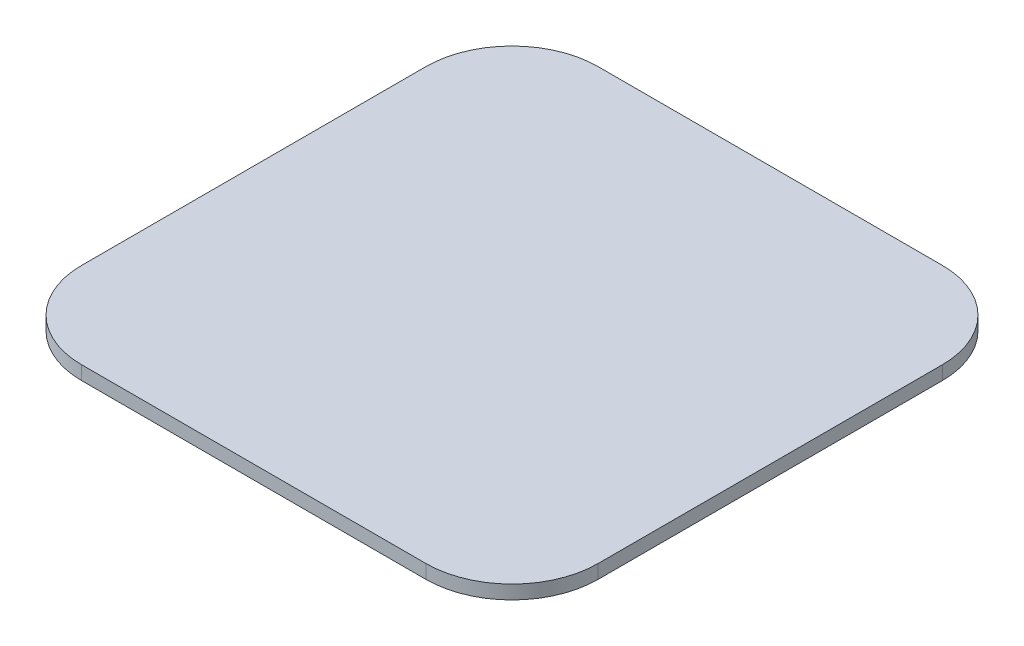
ISO-10303-21;
HEADER;
FILE_DESCRIPTION(('STEP AP214'),'2;1');
FILE_NAME('part.step','',(''),(''),'','','');
FILE_SCHEMA(('AUTOMOTIVE_DESIGN { 1 0 10303 214 1 1 1 1 }'));
ENDSEC;
DATA;
#1=APPLICATION_CONTEXT('core data for automotive mechanical design processes');
#2=APPLICATION_PROTOCOL_DEFINITION('international standard','automotive_design',2000,#1);
#3=PRODUCT_CONTEXT('',#1,'mechanical');
#4=PRODUCT('Part','Part','',(#3));
#5=PRODUCT_RELATED_PRODUCT_CATEGORY('part','',(#4));
#6=PRODUCT_DEFINITION_FORMATION('','',#4);
#7=PRODUCT_DEFINITION_CONTEXT('part definition',#1,'design');
#8=PRODUCT_DEFINITION('design','',#6,#7);
#9=PRODUCT_DEFINITION_SHAPE('','',#8);
#10=(LENGTH_UNIT() NAMED_UNIT(*) SI_UNIT(.MILLI.,.METRE.));
#11=(NAMED_UNIT(*) PLANE_ANGLE_UNIT() SI_UNIT($,.RADIAN.));
#12=(NAMED_UNIT(*) SI_UNIT($,.STERADIAN.) SOLID_ANGLE_UNIT());
#13=UNCERTAINTY_MEASURE_WITH_UNIT(LENGTH_MEASURE(1.E-05),#10,'distance_accuracy_value','');
#14=(GEOMETRIC_REPRESENTATION_CONTEXT(3) GLOBAL_UNCERTAINTY_ASSIGNED_CONTEXT((#13)) GLOBAL_UNIT_ASSIGNED_CONTEXT((#10,
#11,#12)) REPRESENTATION_CONTEXT('',''));
#15=CARTESIAN_POINT('',(0.,0.,0.));
#16=DIRECTION('',(0.,0.,1.));
#17=DIRECTION('',(1.,0.,0.));
#18=AXIS2_PLACEMENT_3D('',#15,#16,#17);
#19=CARTESIAN_POINT('',(0.,0.2,0.));
#20=DIRECTION('',(0.,-1.,0.));
#21=DIRECTION('',(0.,0.,-1.));
#22=AXIS2_PLACEMENT_3D('',#19,#20,#21);
#23=CYLINDRICAL_SURFACE('',#22,5.);
#24=CARTESIAN_POINT('',(0.,0.2,0.));
#25=DIRECTION('',(0.,1.,0.));
#26=DIRECTION('',(0.,0.,1.));
#27=AXIS2_PLACEMENT_3D('',#24,#25,#26);
#28=CIRCLE('',#27,5.);
#29=CARTESIAN_POINT('',(0.,0.2,5.));
#30=VERTEX_POINT('',#29);
#31=EDGE_CURVE('E139',#30,#30,#28,.T.);
#32=ORIENTED_EDGE('',*,*,#31,.F.);
#33=EDGE_LOOP('',(#32));
#34=FACE_BOUND('',#33,.T.);
#35=CARTESIAN_POINT('',(0.,0.,0.));
#36=DIRECTION('',(0.,1.,0.));
#37=DIRECTION('',(0.,0.,1.));
#38=AXIS2_PLACEMENT_3D('',#35,#36,#37);
#39=CIRCLE('',#38,5.);
#40=CARTESIAN_POINT('',(0.,0.,5.));
#41=VERTEX_POINT('',#40);
#42=EDGE_CURVE('E142',#41,#41,#39,.T.);
#43=ORIENTED_EDGE('',*,*,#42,.T.);
#44=EDGE_LOOP('',(#43));
#45=FACE_BOUND('',#44,.T.);
#46=ADVANCED_FACE('F35',(#34,#45),#23,.T.);
#47=CARTESIAN_POINT('',(0.,0.,0.));
#48=DIRECTION('',(0.,1.,0.));
#49=DIRECTION('',(0.,0.,1.));
#50=AXIS2_PLACEMENT_3D('',#47,#48,#49);
#51=PLANE('',#50);
#52=ORIENTED_EDGE('',*,*,#42,.F.);
#53=EDGE_LOOP('',(#52));
#54=FACE_BOUND('',#53,.T.);
#55=ADVANCED_FACE('F192',(#54),#51,.F.);
#56=CARTESIAN_POINT('',(7.5,0.6,-7.5));
#57=DIRECTION('',(-1.,0.,0.));
#58=DIRECTION('',(0.,0.,1.));
#59=AXIS2_PLACEMENT_3D('',#56,#57,#58);
#60=PLANE('',#59);
#61=DIRECTION('',(0.,0.,-1.));
#62=VECTOR('',#61,1.);
#63=CARTESIAN_POINT('',(7.5,0.6,-7.5));
#64=LINE('',#63,#62);
#65=CARTESIAN_POINT('',(7.5,0.6,5.));
#66=VERTEX_POINT('',#65);
#67=CARTESIAN_POINT('',(7.5,0.6,-5.));
#68=VERTEX_POINT('',#67);
#69=EDGE_CURVE('E121',#66,#68,#64,.T.);
#70=ORIENTED_EDGE('',*,*,#69,.F.);
#71=DIRECTION('',(0.,-1.,0.));
#72=VECTOR('',#71,1.);
#73=CARTESIAN_POINT('',(7.5,0.6,5.));
#74=LINE('',#73,#72);
#75=CARTESIAN_POINT('',(7.5,0.2,5.));
#76=VERTEX_POINT('',#75);
#77=EDGE_CURVE('E105',#66,#76,#74,.T.);
#78=ORIENTED_EDGE('',*,*,#77,.T.);
#79=DIRECTION('',(0.,0.,-1.));
#80=VECTOR('',#79,1.);
#81=CARTESIAN_POINT('',(7.5,0.2,-7.5));
#82=LINE('',#81,#80);
#83=CARTESIAN_POINT('',(7.5,0.2,-5.));
#84=VERTEX_POINT('',#83);
#85=EDGE_CURVE('E118',#76,#84,#82,.T.);
#86=ORIENTED_EDGE('',*,*,#85,.T.);
#87=DIRECTION('',(0.,-1.,0.));
#88=VECTOR('',#87,1.);
#89=CARTESIAN_POINT('',(7.5,0.6,-5.));
#90=LINE('',#89,#88);
#91=EDGE_CURVE('E123',#84,#68,#90,.F.);
#92=ORIENTED_EDGE('',*,*,#91,.T.);
#93=EDGE_LOOP('',(#70,#78,#86,#92));
#94=FACE_BOUND('',#93,.T.);
#95=ADVANCED_FACE('F117',(#94),#60,.F.);
#96=CARTESIAN_POINT('',(-7.5,0.6,-7.5));
#97=DIRECTION('',(0.,0.,1.));
#98=DIRECTION('',(1.,0.,0.));
#99=AXIS2_PLACEMENT_3D('',#96,#97,#98);
#100=PLANE('',#99);
#101=DIRECTION('',(-1.,0.,0.));
#102=VECTOR('',#101,1.);
#103=CARTESIAN_POINT('',(-7.5,0.6,-7.5));
#104=LINE('',#103,#102);
#105=CARTESIAN_POINT('',(5.,0.6,-7.5));
#106=VERTEX_POINT('',#105);
#107=CARTESIAN_POINT('',(-5.,0.6,-7.5));
#108=VERTEX_POINT('',#107);
#109=EDGE_CURVE('E169',#106,#108,#104,.T.);
#110=ORIENTED_EDGE('',*,*,#109,.F.);
#111=DIRECTION('',(0.,-1.,0.));
#112=VECTOR('',#111,1.);
#113=CARTESIAN_POINT('',(5.,0.6,-7.5));
#114=LINE('',#113,#112);
#115=CARTESIAN_POINT('',(5.,0.2,-7.5));
#116=VERTEX_POINT('',#115);
#117=EDGE_CURVE('E162',#106,#116,#114,.T.);
#118=ORIENTED_EDGE('',*,*,#117,.T.);
#119=DIRECTION('',(-1.,0.,0.));
#120=VECTOR('',#119,1.);
#121=CARTESIAN_POINT('',(-7.5,0.2,-7.5));
#122=LINE('',#121,#120);
#123=CARTESIAN_POINT('',(-5.,0.2,-7.5));
#124=VERTEX_POINT('',#123);
#125=EDGE_CURVE('E127',#116,#124,#122,.T.);
#126=ORIENTED_EDGE('',*,*,#125,.T.);
#127=DIRECTION('',(0.,-1.,0.));
#128=VECTOR('',#127,1.);
#129=CARTESIAN_POINT('',(-5.,0.6,-7.5));
#130=LINE('',#129,#128);
#131=EDGE_CURVE('E160',#124,#108,#130,.F.);
#132=ORIENTED_EDGE('',*,*,#131,.T.);
#133=EDGE_LOOP('',(#110,#118,#126,#132));
#134=FACE_BOUND('',#133,.T.);
#135=ADVANCED_FACE('F167',(#134),#100,.F.);
#136=CARTESIAN_POINT('',(-7.5,0.6,-7.5));
#137=DIRECTION('',(1.,0.,0.));
#138=DIRECTION('',(0.,0.,-1.));
#139=AXIS2_PLACEMENT_3D('',#136,#137,#138);
#140=PLANE('',#139);
#141=DIRECTION('',(0.,0.,1.));
#142=VECTOR('',#141,1.);
#143=CARTESIAN_POINT('',(-7.5,0.6,-7.5));
#144=LINE('',#143,#142);
#145=CARTESIAN_POINT('',(-7.5,0.6,-5.));
#146=VERTEX_POINT('',#145);
#147=CARTESIAN_POINT('',(-7.5,0.6,5.));
#148=VERTEX_POINT('',#147);
#149=EDGE_CURVE('E177',#146,#148,#144,.T.);
#150=ORIENTED_EDGE('',*,*,#149,.F.);
#151=DIRECTION('',(0.,-1.,0.));
#152=VECTOR('',#151,1.);
#153=CARTESIAN_POINT('',(-7.5,0.6,-5.));
#154=LINE('',#153,#152);
#155=CARTESIAN_POINT('',(-7.5,0.2,-5.));
#156=VERTEX_POINT('',#155);
#157=EDGE_CURVE('E11',#146,#156,#154,.T.);
#158=ORIENTED_EDGE('',*,*,#157,.T.);
#159=DIRECTION('',(0.,0.,1.));
#160=VECTOR('',#159,1.);
#161=CARTESIAN_POINT('',(-7.5,0.2,-7.5));
#162=LINE('',#161,#160);
#163=CARTESIAN_POINT('',(-7.5,0.2,5.));
#164=VERTEX_POINT('',#163);
#165=EDGE_CURVE('E130',#156,#164,#162,.T.);
#166=ORIENTED_EDGE('',*,*,#165,.T.);
#167=DIRECTION('',(0.,-1.,0.));
#168=VECTOR('',#167,1.);
#169=CARTESIAN_POINT('',(-7.5,0.6,5.));
#170=LINE('',#169,#168);
#171=EDGE_CURVE('E43',#164,#148,#170,.F.);
#172=ORIENTED_EDGE('',*,*,#171,.T.);
#173=EDGE_LOOP('',(#150,#158,#166,#172));
#174=FACE_BOUND('',#173,.T.);
#175=ADVANCED_FACE('F176',(#174),#140,.F.);
#176=CARTESIAN_POINT('',(-7.5,0.6,7.5));
#177=DIRECTION('',(0.,0.,-1.));
#178=DIRECTION('',(-1.,0.,0.));
#179=AXIS2_PLACEMENT_3D('',#176,#177,#178);
#180=PLANE('',#179);
#181=DIRECTION('',(1.,0.,0.));
#182=VECTOR('',#181,1.);
#183=CARTESIAN_POINT('',(-7.5,0.2,7.5));
#184=LINE('',#183,#182);
#185=CARTESIAN_POINT('',(-5.,0.2,7.5));
#186=VERTEX_POINT('',#185);
#187=CARTESIAN_POINT('',(5.,0.2,7.5));
#188=VERTEX_POINT('',#187);
#189=EDGE_CURVE('E137',#186,#188,#184,.T.);
#190=ORIENTED_EDGE('',*,*,#189,.T.);
#191=DIRECTION('',(0.,-1.,0.));
#192=VECTOR('',#191,1.);
#193=CARTESIAN_POINT('',(5.,0.6,7.5));
#194=LINE('',#193,#192);
#195=CARTESIAN_POINT('',(5.,0.6,7.5));
#196=VERTEX_POINT('',#195);
#197=EDGE_CURVE('E106',#188,#196,#194,.F.);
#198=ORIENTED_EDGE('',*,*,#197,.T.);
#199=DIRECTION('',(1.,0.,0.));
#200=VECTOR('',#199,1.);
#201=CARTESIAN_POINT('',(-7.5,0.6,7.5));
#202=LINE('',#201,#200);
#203=CARTESIAN_POINT('',(-5.,0.6,7.5));
#204=VERTEX_POINT('',#203);
#205=EDGE_CURVE('E133',#204,#196,#202,.T.);
#206=ORIENTED_EDGE('',*,*,#205,.F.);
#207=DIRECTION('',(0.,-1.,0.));
#208=VECTOR('',#207,1.);
#209=CARTESIAN_POINT('',(-5.,0.6,7.5));
#210=LINE('',#209,#208);
#211=EDGE_CURVE('E111',#204,#186,#210,.T.);
#212=ORIENTED_EDGE('',*,*,#211,.T.);
#213=EDGE_LOOP('',(#190,#198,#206,#212));
#214=FACE_BOUND('',#213,.T.);
#215=ADVANCED_FACE('F209',(#214),#180,.F.);
#216=CARTESIAN_POINT('',(0.,0.6,0.));
#217=DIRECTION('',(0.,1.,0.));
#218=DIRECTION('',(0.,0.,1.));
#219=AXIS2_PLACEMENT_3D('',#216,#217,#218);
#220=PLANE('',#219);
#221=ORIENTED_EDGE('',*,*,#205,.T.);
#222=CARTESIAN_POINT('',(5.,0.6,5.));
#223=DIRECTION('',(0.,1.,0.));
#224=DIRECTION('',(0.,0.,1.));
#225=AXIS2_PLACEMENT_3D('',#222,#223,#224);
#226=CIRCLE('',#225,2.5);
#227=EDGE_CURVE('E158',#196,#66,#226,.T.);
#228=ORIENTED_EDGE('',*,*,#227,.T.);
#229=ORIENTED_EDGE('',*,*,#69,.T.);
#230=CARTESIAN_POINT('',(5.,0.6,-5.));
#231=DIRECTION('',(0.,1.,0.));
#232=DIRECTION('',(0.,0.,1.));
#233=AXIS2_PLACEMENT_3D('',#230,#231,#232);
#234=CIRCLE('',#233,2.5);
#235=EDGE_CURVE('E156',#68,#106,#234,.T.);
#236=ORIENTED_EDGE('',*,*,#235,.T.);
#237=ORIENTED_EDGE('',*,*,#109,.T.);
#238=CARTESIAN_POINT('',(-5.,0.6,-5.));
#239=DIRECTION('',(0.,1.,0.));
#240=DIRECTION('',(0.,0.,1.));
#241=AXIS2_PLACEMENT_3D('',#238,#239,#240);
#242=CIRCLE('',#241,2.5);
#243=EDGE_CURVE('E56',#108,#146,#242,.T.);
#244=ORIENTED_EDGE('',*,*,#243,.T.);
#245=ORIENTED_EDGE('',*,*,#149,.T.);
#246=CARTESIAN_POINT('',(-5.,0.6,5.));
#247=DIRECTION('',(0.,1.,0.));
#248=DIRECTION('',(0.,0.,1.));
#249=AXIS2_PLACEMENT_3D('',#246,#247,#248);
#250=CIRCLE('',#249,2.5);
#251=EDGE_CURVE('E153',#148,#204,#250,.T.);
#252=ORIENTED_EDGE('',*,*,#251,.T.);
#253=EDGE_LOOP('',(#221,#228,#229,#236,#237,#244,#245,#252));
#254=FACE_BOUND('',#253,.T.);
#255=ADVANCED_FACE('F182',(#254),#220,.T.);
#256=CARTESIAN_POINT('',(0.,0.2,0.));
#257=DIRECTION('',(0.,1.,0.));
#258=DIRECTION('',(0.,0.,1.));
#259=AXIS2_PLACEMENT_3D('',#256,#257,#258);
#260=PLANE('',#259);
#261=ORIENTED_EDGE('',*,*,#31,.T.);
#262=EDGE_LOOP('',(#261));
#263=FACE_BOUND('',#262,.T.);
#264=ORIENTED_EDGE('',*,*,#85,.F.);
#265=CARTESIAN_POINT('',(5.,0.2,5.));
#266=DIRECTION('',(0.,1.,0.));
#267=DIRECTION('',(0.,0.,1.));
#268=AXIS2_PLACEMENT_3D('',#265,#266,#267);
#269=CIRCLE('',#268,2.5);
#270=EDGE_CURVE('E101',#76,#188,#269,.F.);
#271=ORIENTED_EDGE('',*,*,#270,.T.);
#272=ORIENTED_EDGE('',*,*,#189,.F.);
#273=CARTESIAN_POINT('',(-5.,0.2,5.));
#274=DIRECTION('',(0.,1.,0.));
#275=DIRECTION('',(0.,0.,1.));
#276=AXIS2_PLACEMENT_3D('',#273,#274,#275);
#277=CIRCLE('',#276,2.5);
#278=EDGE_CURVE('E122',#186,#164,#277,.F.);
#279=ORIENTED_EDGE('',*,*,#278,.T.);
#280=ORIENTED_EDGE('',*,*,#165,.F.);
#281=CARTESIAN_POINT('',(-5.,0.2,-5.));
#282=DIRECTION('',(0.,1.,0.));
#283=DIRECTION('',(0.,0.,1.));
#284=AXIS2_PLACEMENT_3D('',#281,#282,#283);
#285=CIRCLE('',#284,2.5);
#286=EDGE_CURVE('E147',#156,#124,#285,.F.);
#287=ORIENTED_EDGE('',*,*,#286,.T.);
#288=ORIENTED_EDGE('',*,*,#125,.F.);
#289=CARTESIAN_POINT('',(5.,0.2,-5.));
#290=DIRECTION('',(0.,1.,0.));
#291=DIRECTION('',(0.,0.,1.));
#292=AXIS2_PLACEMENT_3D('',#289,#290,#291);
#293=CIRCLE('',#292,2.5);
#294=EDGE_CURVE('E112',#116,#84,#293,.F.);
#295=ORIENTED_EDGE('',*,*,#294,.T.);
#296=EDGE_LOOP('',(#264,#271,#272,#279,#280,#287,#288,#295));
#297=FACE_BOUND('',#296,.T.);
#298=ADVANCED_FACE('F125',(#263,#297),#260,.F.);
#299=CARTESIAN_POINT('',(5.,0.6,5.));
#300=DIRECTION('',(0.,-1.,0.));
#301=DIRECTION('',(0.,0.,-1.));
#302=AXIS2_PLACEMENT_3D('',#299,#300,#301);
#303=CYLINDRICAL_SURFACE('',#302,2.5);
#304=ORIENTED_EDGE('',*,*,#227,.F.);
#305=ORIENTED_EDGE('',*,*,#197,.F.);
#306=ORIENTED_EDGE('',*,*,#270,.F.);
#307=ORIENTED_EDGE('',*,*,#77,.F.);
#308=EDGE_LOOP('',(#304,#305,#306,#307));
#309=FACE_BOUND('',#308,.T.);
#310=ADVANCED_FACE('F104',(#309),#303,.T.);
#311=CARTESIAN_POINT('',(5.,0.6,-5.));
#312=DIRECTION('',(0.,-1.,0.));
#313=DIRECTION('',(0.,0.,-1.));
#314=AXIS2_PLACEMENT_3D('',#311,#312,#313);
#315=CYLINDRICAL_SURFACE('',#314,2.5);
#316=ORIENTED_EDGE('',*,*,#235,.F.);
#317=ORIENTED_EDGE('',*,*,#91,.F.);
#318=ORIENTED_EDGE('',*,*,#294,.F.);
#319=ORIENTED_EDGE('',*,*,#117,.F.);
#320=EDGE_LOOP('',(#316,#317,#318,#319));
#321=FACE_BOUND('',#320,.T.);
#322=ADVANCED_FACE('F183',(#321),#315,.T.);
#323=CARTESIAN_POINT('',(-5.,0.6,-5.));
#324=DIRECTION('',(0.,-1.,0.));
#325=DIRECTION('',(0.,0.,-1.));
#326=AXIS2_PLACEMENT_3D('',#323,#324,#325);
#327=CYLINDRICAL_SURFACE('',#326,2.5);
#328=ORIENTED_EDGE('',*,*,#243,.F.);
#329=ORIENTED_EDGE('',*,*,#131,.F.);
#330=ORIENTED_EDGE('',*,*,#286,.F.);
#331=ORIENTED_EDGE('',*,*,#157,.F.);
#332=EDGE_LOOP('',(#328,#329,#330,#331));
#333=FACE_BOUND('',#332,.T.);
#334=ADVANCED_FACE('F175',(#333),#327,.T.);
#335=CARTESIAN_POINT('',(-5.,0.6,5.));
#336=DIRECTION('',(0.,-1.,0.));
#337=DIRECTION('',(0.,0.,-1.));
#338=AXIS2_PLACEMENT_3D('',#335,#336,#337);
#339=CYLINDRICAL_SURFACE('',#338,2.5);
#340=ORIENTED_EDGE('',*,*,#251,.F.);
#341=ORIENTED_EDGE('',*,*,#171,.F.);
#342=ORIENTED_EDGE('',*,*,#278,.F.);
#343=ORIENTED_EDGE('',*,*,#211,.F.);
#344=EDGE_LOOP('',(#340,#341,#342,#343));
#345=FACE_BOUND('',#344,.T.);
#346=ADVANCED_FACE('F37',(#345),#339,.T.);
#347=CLOSED_SHELL('',(#46,#55,#95,#135,#175,#215,#255,#298,#310,#322,#334,#346));
#348=MANIFOLD_SOLID_BREP('B2',#347);
#349=ADVANCED_BREP_SHAPE_REPRESENTATION('',(#18,#348),#14);
#350=SHAPE_DEFINITION_REPRESENTATION(#9,#349);
ENDSEC;
END-ISO-10303-21;
